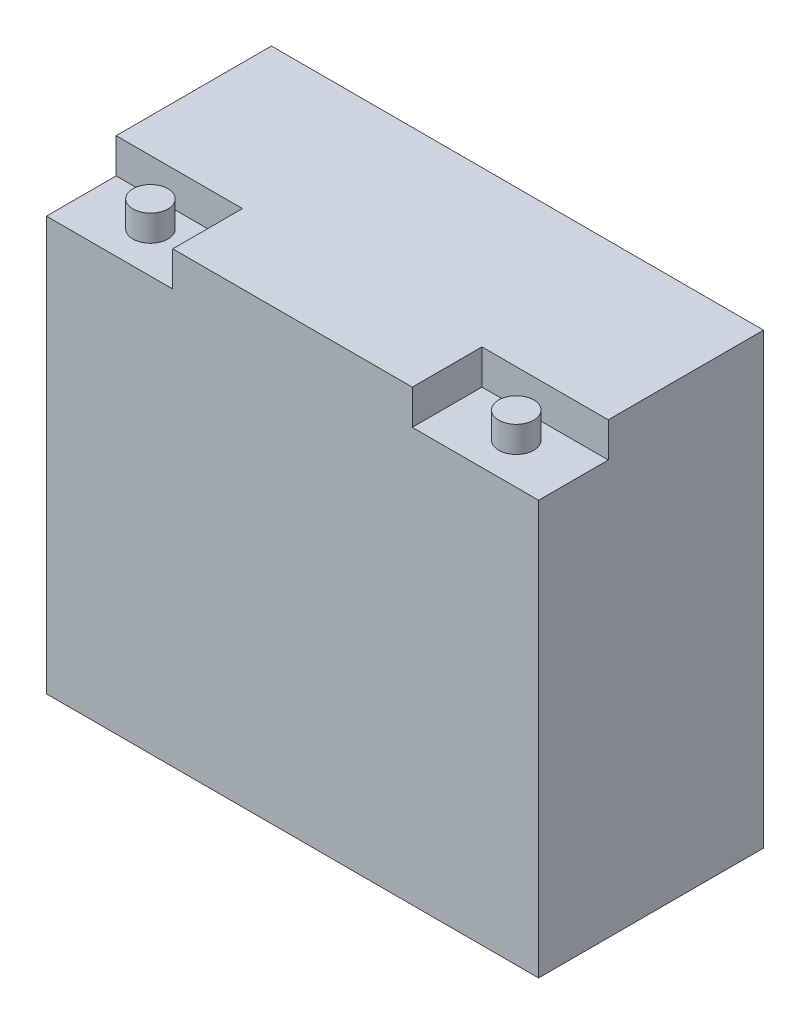
ISO-10303-21;
HEADER;
FILE_DESCRIPTION(('STEP AP214'),'2;1');
FILE_NAME('part.step','',(''),(''),'','','');
FILE_SCHEMA(('AUTOMOTIVE_DESIGN { 1 0 10303 214 1 1 1 1 }'));
ENDSEC;
DATA;
#1=APPLICATION_CONTEXT('core data for automotive mechanical design processes');
#2=APPLICATION_PROTOCOL_DEFINITION('international standard','automotive_design',2000,#1);
#3=PRODUCT_CONTEXT('',#1,'mechanical');
#4=PRODUCT('Part','Part','',(#3));
#5=PRODUCT_RELATED_PRODUCT_CATEGORY('part','',(#4));
#6=PRODUCT_DEFINITION_FORMATION('','',#4);
#7=PRODUCT_DEFINITION_CONTEXT('part definition',#1,'design');
#8=PRODUCT_DEFINITION('design','',#6,#7);
#9=PRODUCT_DEFINITION_SHAPE('','',#8);
#10=(LENGTH_UNIT() NAMED_UNIT(*) SI_UNIT(.MILLI.,.METRE.));
#11=(NAMED_UNIT(*) PLANE_ANGLE_UNIT() SI_UNIT($,.RADIAN.));
#12=(NAMED_UNIT(*) SI_UNIT($,.STERADIAN.) SOLID_ANGLE_UNIT());
#13=UNCERTAINTY_MEASURE_WITH_UNIT(LENGTH_MEASURE(1.E-05),#10,'distance_accuracy_value','');
#14=(GEOMETRIC_REPRESENTATION_CONTEXT(3) GLOBAL_UNCERTAINTY_ASSIGNED_CONTEXT((#13)) GLOBAL_UNIT_ASSIGNED_CONTEXT((#10,
#11,#12)) REPRESENTATION_CONTEXT('',''));
#15=CARTESIAN_POINT('',(0.,0.,0.));
#16=DIRECTION('',(0.,0.,1.));
#17=DIRECTION('',(1.,0.,0.));
#18=AXIS2_PLACEMENT_3D('',#15,#16,#17);
#19=CARTESIAN_POINT('',(0.,163.5125,0.));
#20=DIRECTION('',(1.,0.,0.));
#21=DIRECTION('',(0.,0.,-1.));
#22=AXIS2_PLACEMENT_3D('',#19,#20,#21);
#23=PLANE('',#22);
#24=DIRECTION('',(0.,0.,1.));
#25=VECTOR('',#24,1.);
#26=CARTESIAN_POINT('',(0.,150.8125,0.));
#27=LINE('',#26,#25);
#28=CARTESIAN_POINT('',(0.,150.8125,-25.4));
#29=VERTEX_POINT('',#28);
#30=CARTESIAN_POINT('',(0.,150.8125,0.));
#31=VERTEX_POINT('',#30);
#32=EDGE_CURVE('E139',#29,#31,#27,.T.);
#33=ORIENTED_EDGE('',*,*,#32,.F.);
#34=DIRECTION('',(0.,1.,0.));
#35=VECTOR('',#34,1.);
#36=CARTESIAN_POINT('',(0.,150.8125,-25.4));
#37=LINE('',#36,#35);
#38=CARTESIAN_POINT('',(0.,163.5125,-25.4));
#39=VERTEX_POINT('',#38);
#40=EDGE_CURVE('E154',#29,#39,#37,.T.);
#41=ORIENTED_EDGE('',*,*,#40,.T.);
#42=DIRECTION('',(0.,0.,1.));
#43=VECTOR('',#42,1.);
#44=CARTESIAN_POINT('',(0.,163.5125,0.));
#45=LINE('',#44,#43);
#46=CARTESIAN_POINT('',(0.,163.5125,-82.0057142857143));
#47=VERTEX_POINT('',#46);
#48=EDGE_CURVE('E161',#47,#39,#45,.T.);
#49=ORIENTED_EDGE('',*,*,#48,.F.);
#50=DIRECTION('',(0.,-1.,0.));
#51=VECTOR('',#50,1.);
#52=CARTESIAN_POINT('',(0.,163.5125,-82.0057142857143));
#53=LINE('',#52,#51);
#54=CARTESIAN_POINT('',(0.,0.,-82.0057142857143));
#55=VERTEX_POINT('',#54);
#56=EDGE_CURVE('E171',#47,#55,#53,.T.);
#57=ORIENTED_EDGE('',*,*,#56,.T.);
#58=DIRECTION('',(0.,0.,1.));
#59=VECTOR('',#58,1.);
#60=CARTESIAN_POINT('',(0.,0.,0.));
#61=LINE('',#60,#59);
#62=CARTESIAN_POINT('',(0.,0.,0.));
#63=VERTEX_POINT('',#62);
#64=EDGE_CURVE('E157',#55,#63,#61,.T.);
#65=ORIENTED_EDGE('',*,*,#64,.T.);
#66=DIRECTION('',(0.,-1.,0.));
#67=VECTOR('',#66,1.);
#68=CARTESIAN_POINT('',(0.,163.5125,0.));
#69=LINE('',#68,#67);
#70=EDGE_CURVE('E42',#31,#63,#69,.T.);
#71=ORIENTED_EDGE('',*,*,#70,.F.);
#72=EDGE_LOOP('',(#33,#41,#49,#57,#65,#71));
#73=FACE_BOUND('',#72,.T.);
#74=ADVANCED_FACE('F35',(#73),#23,.F.);
#75=CARTESIAN_POINT('',(0.,163.5125,0.));
#76=DIRECTION('',(0.,0.,-1.));
#77=DIRECTION('',(-1.,0.,0.));
#78=AXIS2_PLACEMENT_3D('',#75,#76,#77);
#79=PLANE('',#78);
#80=DIRECTION('',(1.,0.,0.));
#81=VECTOR('',#80,1.);
#82=CARTESIAN_POINT('',(179.3875,150.8125,0.));
#83=LINE('',#82,#81);
#84=CARTESIAN_POINT('',(133.35,150.8125,0.));
#85=VERTEX_POINT('',#84);
#86=CARTESIAN_POINT('',(179.3875,150.8125,0.));
#87=VERTEX_POINT('',#86);
#88=EDGE_CURVE('E124',#85,#87,#83,.T.);
#89=ORIENTED_EDGE('',*,*,#88,.F.);
#90=DIRECTION('',(0.,1.,0.));
#91=VECTOR('',#90,1.);
#92=CARTESIAN_POINT('',(133.35,150.8125,0.));
#93=LINE('',#92,#91);
#94=CARTESIAN_POINT('',(133.35,163.5125,0.));
#95=VERTEX_POINT('',#94);
#96=EDGE_CURVE('E134',#85,#95,#93,.T.);
#97=ORIENTED_EDGE('',*,*,#96,.T.);
#98=DIRECTION('',(1.,0.,0.));
#99=VECTOR('',#98,1.);
#100=CARTESIAN_POINT('',(0.,163.5125,0.));
#101=LINE('',#100,#99);
#102=CARTESIAN_POINT('',(46.0375,163.5125,0.));
#103=VERTEX_POINT('',#102);
#104=EDGE_CURVE('E164',#103,#95,#101,.T.);
#105=ORIENTED_EDGE('',*,*,#104,.F.);
#106=DIRECTION('',(0.,1.,0.));
#107=VECTOR('',#106,1.);
#108=CARTESIAN_POINT('',(46.0375,150.8125,0.));
#109=LINE('',#108,#107);
#110=CARTESIAN_POINT('',(46.0375,150.8125,0.));
#111=VERTEX_POINT('',#110);
#112=EDGE_CURVE('E57',#111,#103,#109,.T.);
#113=ORIENTED_EDGE('',*,*,#112,.F.);
#114=DIRECTION('',(1.,0.,0.));
#115=VECTOR('',#114,1.);
#116=CARTESIAN_POINT('',(0.,150.8125,0.));
#117=LINE('',#116,#115);
#118=EDGE_CURVE('E141',#31,#111,#117,.T.);
#119=ORIENTED_EDGE('',*,*,#118,.F.);
#120=ORIENTED_EDGE('',*,*,#70,.T.);
#121=DIRECTION('',(1.,0.,0.));
#122=VECTOR('',#121,1.);
#123=CARTESIAN_POINT('',(0.,0.,0.));
#124=LINE('',#123,#122);
#125=CARTESIAN_POINT('',(179.3875,0.,0.));
#126=VERTEX_POINT('',#125);
#127=EDGE_CURVE('E174',#63,#126,#124,.T.);
#128=ORIENTED_EDGE('',*,*,#127,.T.);
#129=DIRECTION('',(0.,-1.,0.));
#130=VECTOR('',#129,1.);
#131=CARTESIAN_POINT('',(179.3875,163.5125,0.));
#132=LINE('',#131,#130);
#133=EDGE_CURVE('E185',#87,#126,#132,.T.);
#134=ORIENTED_EDGE('',*,*,#133,.F.);
#135=EDGE_LOOP('',(#89,#97,#105,#113,#119,#120,#128,#134));
#136=FACE_BOUND('',#135,.T.);
#137=ADVANCED_FACE('F190',(#136),#79,.F.);
#138=CARTESIAN_POINT('',(179.3875,163.5125,0.));
#139=DIRECTION('',(-1.,0.,0.));
#140=DIRECTION('',(0.,0.,1.));
#141=AXIS2_PLACEMENT_3D('',#138,#139,#140);
#142=PLANE('',#141);
#143=DIRECTION('',(0.,0.,-1.));
#144=VECTOR('',#143,1.);
#145=CARTESIAN_POINT('',(179.3875,163.5125,0.));
#146=LINE('',#145,#144);
#147=CARTESIAN_POINT('',(179.3875,163.5125,-25.4));
#148=VERTEX_POINT('',#147);
#149=CARTESIAN_POINT('',(179.3875,163.5125,-82.0057142857143));
#150=VERTEX_POINT('',#149);
#151=EDGE_CURVE('E132',#148,#150,#146,.T.);
#152=ORIENTED_EDGE('',*,*,#151,.F.);
#153=DIRECTION('',(0.,1.,0.));
#154=VECTOR('',#153,1.);
#155=CARTESIAN_POINT('',(179.3875,150.8125,-25.4));
#156=LINE('',#155,#154);
#157=CARTESIAN_POINT('',(179.3875,150.8125,-25.4));
#158=VERTEX_POINT('',#157);
#159=EDGE_CURVE('E49',#158,#148,#156,.T.);
#160=ORIENTED_EDGE('',*,*,#159,.F.);
#161=DIRECTION('',(0.,0.,-1.));
#162=VECTOR('',#161,1.);
#163=CARTESIAN_POINT('',(179.3875,150.8125,0.));
#164=LINE('',#163,#162);
#165=EDGE_CURVE('E119',#87,#158,#164,.T.);
#166=ORIENTED_EDGE('',*,*,#165,.F.);
#167=ORIENTED_EDGE('',*,*,#133,.T.);
#168=DIRECTION('',(0.,0.,-1.));
#169=VECTOR('',#168,1.);
#170=CARTESIAN_POINT('',(179.3875,0.,0.));
#171=LINE('',#170,#169);
#172=CARTESIAN_POINT('',(179.3875,0.,-82.0057142857143));
#173=VERTEX_POINT('',#172);
#174=EDGE_CURVE('E177',#126,#173,#171,.T.);
#175=ORIENTED_EDGE('',*,*,#174,.T.);
#176=DIRECTION('',(0.,-1.,0.));
#177=VECTOR('',#176,1.);
#178=CARTESIAN_POINT('',(179.3875,163.5125,-82.0057142857143));
#179=LINE('',#178,#177);
#180=EDGE_CURVE('E182',#150,#173,#179,.T.);
#181=ORIENTED_EDGE('',*,*,#180,.F.);
#182=EDGE_LOOP('',(#152,#160,#166,#167,#175,#181));
#183=FACE_BOUND('',#182,.T.);
#184=ADVANCED_FACE('F130',(#183),#142,.F.);
#185=CARTESIAN_POINT('',(0.,163.5125,-82.0057142857143));
#186=DIRECTION('',(0.,0.,1.));
#187=DIRECTION('',(1.,0.,0.));
#188=AXIS2_PLACEMENT_3D('',#185,#186,#187);
#189=PLANE('',#188);
#190=DIRECTION('',(-1.,0.,0.));
#191=VECTOR('',#190,1.);
#192=CARTESIAN_POINT('',(0.,0.,-82.0057142857143));
#193=LINE('',#192,#191);
#194=EDGE_CURVE('E165',#173,#55,#193,.T.);
#195=ORIENTED_EDGE('',*,*,#194,.T.);
#196=ORIENTED_EDGE('',*,*,#56,.F.);
#197=DIRECTION('',(-1.,0.,0.));
#198=VECTOR('',#197,1.);
#199=CARTESIAN_POINT('',(0.,163.5125,-82.0057142857143));
#200=LINE('',#199,#198);
#201=EDGE_CURVE('E169',#150,#47,#200,.T.);
#202=ORIENTED_EDGE('',*,*,#201,.F.);
#203=ORIENTED_EDGE('',*,*,#180,.T.);
#204=EDGE_LOOP('',(#195,#196,#202,#203));
#205=FACE_BOUND('',#204,.T.);
#206=ADVANCED_FACE('F202',(#205),#189,.F.);
#207=CARTESIAN_POINT('',(0.,163.5125,0.));
#208=DIRECTION('',(0.,-1.,0.));
#209=DIRECTION('',(0.,0.,-1.));
#210=AXIS2_PLACEMENT_3D('',#207,#208,#209);
#211=PLANE('',#210);
#212=ORIENTED_EDGE('',*,*,#104,.T.);
#213=DIRECTION('',(0.,0.,1.));
#214=VECTOR('',#213,1.);
#215=CARTESIAN_POINT('',(133.35,163.5125,0.));
#216=LINE('',#215,#214);
#217=CARTESIAN_POINT('',(133.35,163.5125,-25.4));
#218=VERTEX_POINT('',#217);
#219=EDGE_CURVE('E127',#218,#95,#216,.T.);
#220=ORIENTED_EDGE('',*,*,#219,.F.);
#221=DIRECTION('',(-1.,0.,0.));
#222=VECTOR('',#221,1.);
#223=CARTESIAN_POINT('',(179.3875,163.5125,-25.4));
#224=LINE('',#223,#222);
#225=EDGE_CURVE('E216',#148,#218,#224,.T.);
#226=ORIENTED_EDGE('',*,*,#225,.F.);
#227=ORIENTED_EDGE('',*,*,#151,.T.);
#228=ORIENTED_EDGE('',*,*,#201,.T.);
#229=ORIENTED_EDGE('',*,*,#48,.T.);
#230=DIRECTION('',(-1.,0.,0.));
#231=VECTOR('',#230,1.);
#232=CARTESIAN_POINT('',(0.,163.5125,-25.4));
#233=LINE('',#232,#231);
#234=CARTESIAN_POINT('',(46.0375,163.5125,-25.4));
#235=VERTEX_POINT('',#234);
#236=EDGE_CURVE('E142',#235,#39,#233,.T.);
#237=ORIENTED_EDGE('',*,*,#236,.F.);
#238=DIRECTION('',(0.,0.,-1.));
#239=VECTOR('',#238,1.);
#240=CARTESIAN_POINT('',(46.0375,163.5125,0.));
#241=LINE('',#240,#239);
#242=EDGE_CURVE('E151',#103,#235,#241,.T.);
#243=ORIENTED_EDGE('',*,*,#242,.F.);
#244=EDGE_LOOP('',(#212,#220,#226,#227,#228,#229,#237,#243));
#245=FACE_BOUND('',#244,.T.);
#246=ADVANCED_FACE('F208',(#245),#211,.F.);
#247=CARTESIAN_POINT('',(0.,0.,0.));
#248=DIRECTION('',(0.,-1.,0.));
#249=DIRECTION('',(0.,0.,-1.));
#250=AXIS2_PLACEMENT_3D('',#247,#248,#249);
#251=PLANE('',#250);
#252=ORIENTED_EDGE('',*,*,#64,.F.);
#253=ORIENTED_EDGE('',*,*,#194,.F.);
#254=ORIENTED_EDGE('',*,*,#174,.F.);
#255=ORIENTED_EDGE('',*,*,#127,.F.);
#256=EDGE_LOOP('',(#252,#253,#254,#255));
#257=FACE_BOUND('',#256,.T.);
#258=ADVANCED_FACE('F196',(#257),#251,.T.);
#259=CARTESIAN_POINT('',(0.,150.8125,-25.4));
#260=DIRECTION('',(0.,0.,-1.));
#261=DIRECTION('',(-1.,0.,0.));
#262=AXIS2_PLACEMENT_3D('',#259,#260,#261);
#263=PLANE('',#262);
#264=ORIENTED_EDGE('',*,*,#236,.T.);
#265=ORIENTED_EDGE('',*,*,#40,.F.);
#266=DIRECTION('',(-1.,0.,0.));
#267=VECTOR('',#266,1.);
#268=CARTESIAN_POINT('',(0.,150.8125,-25.4));
#269=LINE('',#268,#267);
#270=CARTESIAN_POINT('',(46.0375,150.8125,-25.4));
#271=VERTEX_POINT('',#270);
#272=EDGE_CURVE('E148',#271,#29,#269,.T.);
#273=ORIENTED_EDGE('',*,*,#272,.F.);
#274=DIRECTION('',(0.,1.,0.));
#275=VECTOR('',#274,1.);
#276=CARTESIAN_POINT('',(46.0375,150.8125,-25.4));
#277=LINE('',#276,#275);
#278=EDGE_CURVE('E158',#271,#235,#277,.T.);
#279=ORIENTED_EDGE('',*,*,#278,.T.);
#280=EDGE_LOOP('',(#264,#265,#273,#279));
#281=FACE_BOUND('',#280,.T.);
#282=ADVANCED_FACE('F215',(#281),#263,.F.);
#283=CARTESIAN_POINT('',(46.0375,150.8125,0.));
#284=DIRECTION('',(1.,0.,0.));
#285=DIRECTION('',(0.,0.,-1.));
#286=AXIS2_PLACEMENT_3D('',#283,#284,#285);
#287=PLANE('',#286);
#288=ORIENTED_EDGE('',*,*,#242,.T.);
#289=ORIENTED_EDGE('',*,*,#278,.F.);
#290=DIRECTION('',(0.,0.,-1.));
#291=VECTOR('',#290,1.);
#292=CARTESIAN_POINT('',(46.0375,150.8125,0.));
#293=LINE('',#292,#291);
#294=EDGE_CURVE('E145',#111,#271,#293,.T.);
#295=ORIENTED_EDGE('',*,*,#294,.F.);
#296=ORIENTED_EDGE('',*,*,#112,.T.);
#297=EDGE_LOOP('',(#288,#289,#295,#296));
#298=FACE_BOUND('',#297,.T.);
#299=ADVANCED_FACE('F210',(#298),#287,.F.);
#300=CARTESIAN_POINT('',(0.,150.8125,0.));
#301=DIRECTION('',(0.,-1.,0.));
#302=DIRECTION('',(0.,0.,-1.));
#303=AXIS2_PLACEMENT_3D('',#300,#301,#302);
#304=PLANE('',#303);
#305=CARTESIAN_POINT('',(23.01875,150.8125,-14.8862162641308));
#306=DIRECTION('',(0.,-1.,0.));
#307=DIRECTION('',(0.,0.,-1.));
#308=AXIS2_PLACEMENT_3D('',#305,#306,#307);
#309=CIRCLE('',#308,6.38096028607932);
#310=CARTESIAN_POINT('',(23.01875,150.8125,-21.2671765502101));
#311=VERTEX_POINT('',#310);
#312=EDGE_CURVE('E11',#311,#311,#309,.F.);
#313=ORIENTED_EDGE('',*,*,#312,.F.);
#314=EDGE_LOOP('',(#313));
#315=FACE_BOUND('',#314,.T.);
#316=ORIENTED_EDGE('',*,*,#32,.T.);
#317=ORIENTED_EDGE('',*,*,#118,.T.);
#318=ORIENTED_EDGE('',*,*,#294,.T.);
#319=ORIENTED_EDGE('',*,*,#272,.T.);
#320=EDGE_LOOP('',(#316,#317,#318,#319));
#321=FACE_BOUND('',#320,.T.);
#322=ADVANCED_FACE('F214',(#315,#321),#304,.F.);
#323=CARTESIAN_POINT('',(133.35,150.8125,0.));
#324=DIRECTION('',(-1.,0.,0.));
#325=DIRECTION('',(0.,0.,1.));
#326=AXIS2_PLACEMENT_3D('',#323,#324,#325);
#327=PLANE('',#326);
#328=ORIENTED_EDGE('',*,*,#219,.T.);
#329=ORIENTED_EDGE('',*,*,#96,.F.);
#330=DIRECTION('',(0.,0.,1.));
#331=VECTOR('',#330,1.);
#332=CARTESIAN_POINT('',(133.35,150.8125,0.));
#333=LINE('',#332,#331);
#334=CARTESIAN_POINT('',(133.35,150.8125,-25.4));
#335=VERTEX_POINT('',#334);
#336=EDGE_CURVE('E118',#335,#85,#333,.T.);
#337=ORIENTED_EDGE('',*,*,#336,.F.);
#338=DIRECTION('',(0.,1.,0.));
#339=VECTOR('',#338,1.);
#340=CARTESIAN_POINT('',(133.35,150.8125,-25.4));
#341=LINE('',#340,#339);
#342=EDGE_CURVE('E114',#335,#218,#341,.T.);
#343=ORIENTED_EDGE('',*,*,#342,.T.);
#344=EDGE_LOOP('',(#328,#329,#337,#343));
#345=FACE_BOUND('',#344,.T.);
#346=ADVANCED_FACE('F249',(#345),#327,.F.);
#347=CARTESIAN_POINT('',(179.3875,150.8125,-25.4));
#348=DIRECTION('',(0.,0.,-1.));
#349=DIRECTION('',(-1.,0.,0.));
#350=AXIS2_PLACEMENT_3D('',#347,#348,#349);
#351=PLANE('',#350);
#352=ORIENTED_EDGE('',*,*,#225,.T.);
#353=ORIENTED_EDGE('',*,*,#342,.F.);
#354=DIRECTION('',(-1.,0.,0.));
#355=VECTOR('',#354,1.);
#356=CARTESIAN_POINT('',(179.3875,150.8125,-25.4));
#357=LINE('',#356,#355);
#358=EDGE_CURVE('E111',#158,#335,#357,.T.);
#359=ORIENTED_EDGE('',*,*,#358,.F.);
#360=ORIENTED_EDGE('',*,*,#159,.T.);
#361=EDGE_LOOP('',(#352,#353,#359,#360));
#362=FACE_BOUND('',#361,.T.);
#363=ADVANCED_FACE('F113',(#362),#351,.F.);
#364=CARTESIAN_POINT('',(0.,150.8125,0.));
#365=DIRECTION('',(0.,1.,0.));
#366=DIRECTION('',(0.,0.,1.));
#367=AXIS2_PLACEMENT_3D('',#364,#365,#366);
#368=PLANE('',#367);
#369=CARTESIAN_POINT('',(156.36875,150.8125,-14.8862162641308));
#370=DIRECTION('',(0.,1.,0.));
#371=DIRECTION('',(0.,0.,-1.));
#372=AXIS2_PLACEMENT_3D('',#369,#370,#371);
#373=CIRCLE('',#372,6.38096028607932);
#374=CARTESIAN_POINT('',(156.36875,150.8125,-21.2671765502101));
#375=VERTEX_POINT('',#374);
#376=EDGE_CURVE('E225',#375,#375,#373,.T.);
#377=ORIENTED_EDGE('',*,*,#376,.F.);
#378=EDGE_LOOP('',(#377));
#379=FACE_BOUND('',#378,.T.);
#380=ORIENTED_EDGE('',*,*,#165,.T.);
#381=ORIENTED_EDGE('',*,*,#358,.T.);
#382=ORIENTED_EDGE('',*,*,#336,.T.);
#383=ORIENTED_EDGE('',*,*,#88,.T.);
#384=EDGE_LOOP('',(#380,#381,#382,#383));
#385=FACE_BOUND('',#384,.T.);
#386=ADVANCED_FACE('F122',(#379,#385),#368,.T.);
#387=CARTESIAN_POINT('',(23.01875,160.3375,-14.8862162641308));
#388=DIRECTION('',(0.,-1.,0.));
#389=DIRECTION('',(0.,0.,-1.));
#390=AXIS2_PLACEMENT_3D('',#387,#388,#389);
#391=CYLINDRICAL_SURFACE('',#390,6.38096028607932);
#392=CARTESIAN_POINT('',(23.01875,160.3375,-14.8862162641308));
#393=DIRECTION('',(0.,1.,0.));
#394=DIRECTION('',(0.,0.,1.));
#395=AXIS2_PLACEMENT_3D('',#392,#393,#394);
#396=CIRCLE('',#395,6.38096028607932);
#397=CARTESIAN_POINT('',(23.01875,160.3375,-8.50525597805146));
#398=VERTEX_POINT('',#397);
#399=EDGE_CURVE('E217',#398,#398,#396,.T.);
#400=ORIENTED_EDGE('',*,*,#399,.F.);
#401=EDGE_LOOP('',(#400));
#402=FACE_BOUND('',#401,.T.);
#403=ORIENTED_EDGE('',*,*,#312,.T.);
#404=EDGE_LOOP('',(#403));
#405=FACE_BOUND('',#404,.T.);
#406=ADVANCED_FACE('F241',(#402,#405),#391,.T.);
#407=CARTESIAN_POINT('',(23.01875,160.3375,-14.8862162641308));
#408=DIRECTION('',(0.,1.,0.));
#409=DIRECTION('',(0.,0.,1.));
#410=AXIS2_PLACEMENT_3D('',#407,#408,#409);
#411=PLANE('',#410);
#412=ORIENTED_EDGE('',*,*,#399,.T.);
#413=EDGE_LOOP('',(#412));
#414=FACE_BOUND('',#413,.T.);
#415=ADVANCED_FACE('F236',(#414),#411,.T.);
#416=CARTESIAN_POINT('',(156.36875,160.3375,-14.8862162641308));
#417=DIRECTION('',(0.,-1.,0.));
#418=DIRECTION('',(0.,0.,-1.));
#419=AXIS2_PLACEMENT_3D('',#416,#417,#418);
#420=CYLINDRICAL_SURFACE('',#419,6.38096028607932);
#421=CARTESIAN_POINT('',(156.36875,160.3375,-14.8862162641308));
#422=DIRECTION('',(0.,1.,0.));
#423=DIRECTION('',(0.,0.,-1.));
#424=AXIS2_PLACEMENT_3D('',#421,#422,#423);
#425=CIRCLE('',#424,6.38096028607932);
#426=CARTESIAN_POINT('',(156.36875,160.3375,-21.2671765502101));
#427=VERTEX_POINT('',#426);
#428=EDGE_CURVE('E221',#427,#427,#425,.T.);
#429=ORIENTED_EDGE('',*,*,#428,.F.);
#430=EDGE_LOOP('',(#429));
#431=FACE_BOUND('',#430,.T.);
#432=ORIENTED_EDGE('',*,*,#376,.T.);
#433=EDGE_LOOP('',(#432));
#434=FACE_BOUND('',#433,.T.);
#435=ADVANCED_FACE('F233',(#431,#434),#420,.T.);
#436=CARTESIAN_POINT('',(156.36875,160.3375,-14.8862162641308));
#437=DIRECTION('',(0.,-1.,0.));
#438=DIRECTION('',(0.,0.,-1.));
#439=AXIS2_PLACEMENT_3D('',#436,#437,#438);
#440=PLANE('',#439);
#441=ORIENTED_EDGE('',*,*,#428,.T.);
#442=EDGE_LOOP('',(#441));
#443=FACE_BOUND('',#442,.T.);
#444=ADVANCED_FACE('F231',(#443),#440,.F.);
#445=CLOSED_SHELL('',(#74,#137,#184,#206,#246,#258,#282,#299,#322,#346,#363,#386,#406,#415,#435,#444));
#446=MANIFOLD_SOLID_BREP('B2',#445);
#447=ADVANCED_BREP_SHAPE_REPRESENTATION('',(#18,#446),#14);
#448=SHAPE_DEFINITION_REPRESENTATION(#9,#447);
ENDSEC;
END-ISO-10303-21;
